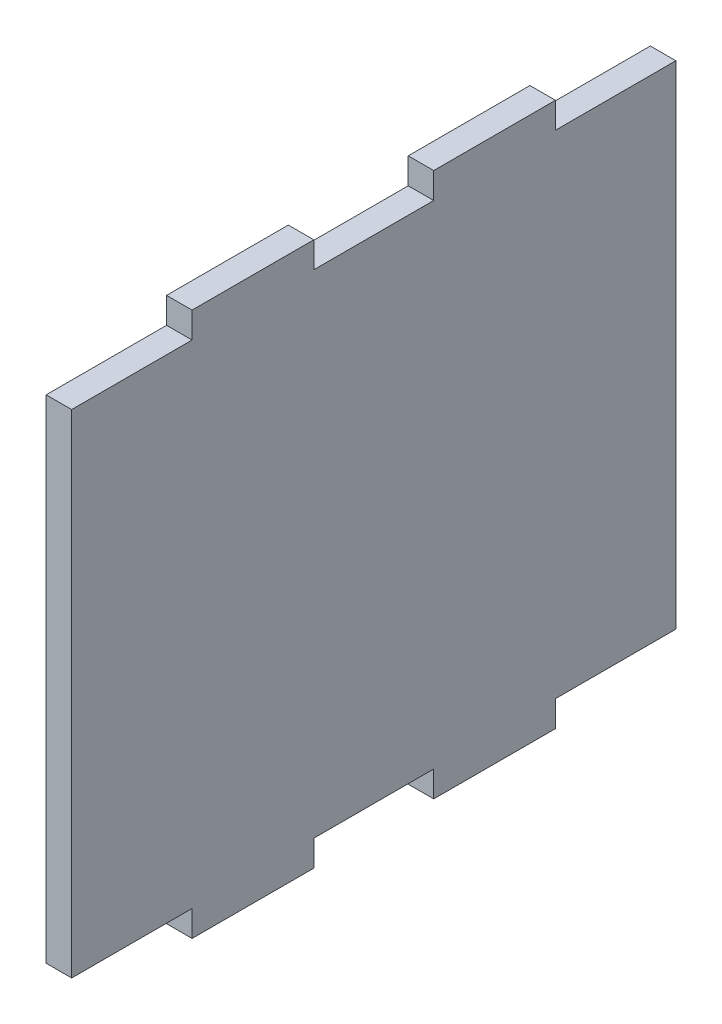
ISO-10303-21;
HEADER;
FILE_DESCRIPTION(('STEP AP214'),'2;1');
FILE_NAME('part.step','',(''),(''),'','','');
FILE_SCHEMA(('AUTOMOTIVE_DESIGN { 1 0 10303 214 1 1 1 1 }'));
ENDSEC;
DATA;
#1=APPLICATION_CONTEXT('core data for automotive mechanical design processes');
#2=APPLICATION_PROTOCOL_DEFINITION('international standard','automotive_design',2000,#1);
#3=PRODUCT_CONTEXT('',#1,'mechanical');
#4=PRODUCT('Part','Part','',(#3));
#5=PRODUCT_RELATED_PRODUCT_CATEGORY('part','',(#4));
#6=PRODUCT_DEFINITION_FORMATION('','',#4);
#7=PRODUCT_DEFINITION_CONTEXT('part definition',#1,'design');
#8=PRODUCT_DEFINITION('design','',#6,#7);
#9=PRODUCT_DEFINITION_SHAPE('','',#8);
#10=(LENGTH_UNIT() NAMED_UNIT(*) SI_UNIT(.MILLI.,.METRE.));
#11=(NAMED_UNIT(*) PLANE_ANGLE_UNIT() SI_UNIT($,.RADIAN.));
#12=(NAMED_UNIT(*) SI_UNIT($,.STERADIAN.) SOLID_ANGLE_UNIT());
#13=UNCERTAINTY_MEASURE_WITH_UNIT(LENGTH_MEASURE(1.E-05),#10,'distance_accuracy_value','');
#14=(GEOMETRIC_REPRESENTATION_CONTEXT(3) GLOBAL_UNCERTAINTY_ASSIGNED_CONTEXT((#13)) GLOBAL_UNIT_ASSIGNED_CONTEXT((#10,
#11,#12)) REPRESENTATION_CONTEXT('',''));
#15=CARTESIAN_POINT('',(0.,0.,0.));
#16=DIRECTION('',(0.,0.,1.));
#17=DIRECTION('',(1.,0.,0.));
#18=AXIS2_PLACEMENT_3D('',#15,#16,#17);
#19=CARTESIAN_POINT('',(5.7,0.,0.));
#20=DIRECTION('',(0.,0.,-1.));
#21=DIRECTION('',(-1.,0.,0.));
#22=AXIS2_PLACEMENT_3D('',#19,#20,#21);
#23=PLANE('',#22);
#24=DIRECTION('',(-1.,0.,0.));
#25=VECTOR('',#24,1.);
#26=CARTESIAN_POINT('',(57.,5.99999999999999,0.));
#27=LINE('',#26,#25);
#28=CARTESIAN_POINT('',(5.7,5.99999999999999,0.));
#29=VERTEX_POINT('',#28);
#30=CARTESIAN_POINT('',(0.,5.99999999999999,0.));
#31=VERTEX_POINT('',#30);
#32=EDGE_CURVE('E49',#29,#31,#27,.T.);
#33=ORIENTED_EDGE('',*,*,#32,.F.);
#34=DIRECTION('',(0.,-1.,0.));
#35=VECTOR('',#34,1.);
#36=CARTESIAN_POINT('',(5.7,0.,0.));
#37=LINE('',#36,#35);
#38=CARTESIAN_POINT('',(5.7,116.,0.));
#39=VERTEX_POINT('',#38);
#40=EDGE_CURVE('E41',#39,#29,#37,.T.);
#41=ORIENTED_EDGE('',*,*,#40,.F.);
#42=DIRECTION('',(-1.,0.,0.));
#43=VECTOR('',#42,1.);
#44=CARTESIAN_POINT('',(57.,116.,0.));
#45=LINE('',#44,#43);
#46=CARTESIAN_POINT('',(0.,116.,0.));
#47=VERTEX_POINT('',#46);
#48=EDGE_CURVE('E218',#39,#47,#45,.T.);
#49=ORIENTED_EDGE('',*,*,#48,.T.);
#50=DIRECTION('',(0.,-1.,0.));
#51=VECTOR('',#50,1.);
#52=CARTESIAN_POINT('',(0.,0.,0.));
#53=LINE('',#52,#51);
#54=EDGE_CURVE('E191',#47,#31,#53,.T.);
#55=ORIENTED_EDGE('',*,*,#54,.T.);
#56=EDGE_LOOP('',(#33,#41,#49,#55));
#57=FACE_BOUND('',#56,.T.);
#58=ADVANCED_FACE('F33',(#57),#23,.F.);
#59=CARTESIAN_POINT('',(5.7,0.,-135.));
#60=DIRECTION('',(0.,0.,1.));
#61=DIRECTION('',(1.,0.,0.));
#62=AXIS2_PLACEMENT_3D('',#59,#60,#61);
#63=PLANE('',#62);
#64=DIRECTION('',(-1.,0.,0.));
#65=VECTOR('',#64,1.);
#66=CARTESIAN_POINT('',(57.,5.99999999999999,-135.));
#67=LINE('',#66,#65);
#68=CARTESIAN_POINT('',(5.7,5.99999999999999,-135.));
#69=VERTEX_POINT('',#68);
#70=CARTESIAN_POINT('',(0.,5.99999999999999,-135.));
#71=VERTEX_POINT('',#70);
#72=EDGE_CURVE('E173',#69,#71,#67,.T.);
#73=ORIENTED_EDGE('',*,*,#72,.T.);
#74=DIRECTION('',(0.,1.,0.));
#75=VECTOR('',#74,1.);
#76=CARTESIAN_POINT('',(0.,0.,-135.));
#77=LINE('',#76,#75);
#78=CARTESIAN_POINT('',(0.,116.,-135.));
#79=VERTEX_POINT('',#78);
#80=EDGE_CURVE('E36',#71,#79,#77,.T.);
#81=ORIENTED_EDGE('',*,*,#80,.T.);
#82=DIRECTION('',(-1.,0.,0.));
#83=VECTOR('',#82,1.);
#84=CARTESIAN_POINT('',(57.,116.,-135.));
#85=LINE('',#84,#83);
#86=CARTESIAN_POINT('',(5.7,116.,-135.));
#87=VERTEX_POINT('',#86);
#88=EDGE_CURVE('E236',#87,#79,#85,.T.);
#89=ORIENTED_EDGE('',*,*,#88,.F.);
#90=DIRECTION('',(0.,1.,0.));
#91=VECTOR('',#90,1.);
#92=CARTESIAN_POINT('',(5.7,0.,-135.));
#93=LINE('',#92,#91);
#94=EDGE_CURVE('E11',#69,#87,#93,.T.);
#95=ORIENTED_EDGE('',*,*,#94,.F.);
#96=EDGE_LOOP('',(#73,#81,#89,#95));
#97=FACE_BOUND('',#96,.T.);
#98=ADVANCED_FACE('F183',(#97),#63,.F.);
#99=CARTESIAN_POINT('',(5.7,0.,0.));
#100=DIRECTION('',(-1.,0.,0.));
#101=DIRECTION('',(0.,0.,1.));
#102=AXIS2_PLACEMENT_3D('',#99,#100,#101);
#103=PLANE('',#102);
#104=DIRECTION('',(0.,0.,1.));
#105=VECTOR('',#104,1.);
#106=CARTESIAN_POINT('',(5.7,5.99999999999999,0.));
#107=LINE('',#106,#105);
#108=CARTESIAN_POINT('',(5.7,5.99999999999999,-108.1));
#109=VERTEX_POINT('',#108);
#110=EDGE_CURVE('E262',#69,#109,#107,.T.);
#111=ORIENTED_EDGE('',*,*,#110,.F.);
#112=ORIENTED_EDGE('',*,*,#94,.T.);
#113=DIRECTION('',(0.,0.,-1.));
#114=VECTOR('',#113,1.);
#115=CARTESIAN_POINT('',(5.7,116.,0.));
#116=LINE('',#115,#114);
#117=CARTESIAN_POINT('',(5.7,116.,-108.1));
#118=VERTEX_POINT('',#117);
#119=EDGE_CURVE('E215',#118,#87,#116,.T.);
#120=ORIENTED_EDGE('',*,*,#119,.F.);
#121=DIRECTION('',(0.,-1.,0.));
#122=VECTOR('',#121,1.);
#123=CARTESIAN_POINT('',(5.7,0.,-108.1));
#124=LINE('',#123,#122);
#125=CARTESIAN_POINT('',(5.7,121.8,-108.1));
#126=VERTEX_POINT('',#125);
#127=EDGE_CURVE('E213',#126,#118,#124,.T.);
#128=ORIENTED_EDGE('',*,*,#127,.F.);
#129=DIRECTION('',(0.,0.,-1.));
#130=VECTOR('',#129,1.);
#131=CARTESIAN_POINT('',(5.7,121.8,0.));
#132=LINE('',#131,#130);
#133=CARTESIAN_POINT('',(5.7,121.8,-80.9));
#134=VERTEX_POINT('',#133);
#135=EDGE_CURVE('E211',#134,#126,#132,.T.);
#136=ORIENTED_EDGE('',*,*,#135,.F.);
#137=DIRECTION('',(0.,1.,0.));
#138=VECTOR('',#137,1.);
#139=CARTESIAN_POINT('',(5.7,0.,-80.9));
#140=LINE('',#139,#138);
#141=CARTESIAN_POINT('',(5.7,116.,-80.9));
#142=VERTEX_POINT('',#141);
#143=EDGE_CURVE('E209',#142,#134,#140,.T.);
#144=ORIENTED_EDGE('',*,*,#143,.F.);
#145=DIRECTION('',(0.,0.,-1.));
#146=VECTOR('',#145,1.);
#147=CARTESIAN_POINT('',(5.7,116.,0.));
#148=LINE('',#147,#146);
#149=CARTESIAN_POINT('',(5.7,116.,-54.1));
#150=VERTEX_POINT('',#149);
#151=EDGE_CURVE('E207',#150,#142,#148,.T.);
#152=ORIENTED_EDGE('',*,*,#151,.F.);
#153=DIRECTION('',(0.,-1.,0.));
#154=VECTOR('',#153,1.);
#155=CARTESIAN_POINT('',(5.7,0.,-54.1));
#156=LINE('',#155,#154);
#157=CARTESIAN_POINT('',(5.7,121.8,-54.1));
#158=VERTEX_POINT('',#157);
#159=EDGE_CURVE('E205',#158,#150,#156,.T.);
#160=ORIENTED_EDGE('',*,*,#159,.F.);
#161=DIRECTION('',(0.,0.,-1.));
#162=VECTOR('',#161,1.);
#163=CARTESIAN_POINT('',(5.7,121.8,0.));
#164=LINE('',#163,#162);
#165=CARTESIAN_POINT('',(5.7,121.8,-26.9));
#166=VERTEX_POINT('',#165);
#167=EDGE_CURVE('E203',#166,#158,#164,.T.);
#168=ORIENTED_EDGE('',*,*,#167,.F.);
#169=DIRECTION('',(0.,1.,0.));
#170=VECTOR('',#169,1.);
#171=CARTESIAN_POINT('',(5.7,0.,-26.9));
#172=LINE('',#171,#170);
#173=CARTESIAN_POINT('',(5.7,116.,-26.9));
#174=VERTEX_POINT('',#173);
#175=EDGE_CURVE('E199',#174,#166,#172,.T.);
#176=ORIENTED_EDGE('',*,*,#175,.F.);
#177=DIRECTION('',(0.,0.,-1.));
#178=VECTOR('',#177,1.);
#179=CARTESIAN_POINT('',(5.7,116.,0.));
#180=LINE('',#179,#178);
#181=EDGE_CURVE('E195',#39,#174,#180,.T.);
#182=ORIENTED_EDGE('',*,*,#181,.F.);
#183=ORIENTED_EDGE('',*,*,#40,.T.);
#184=DIRECTION('',(0.,0.,1.));
#185=VECTOR('',#184,1.);
#186=CARTESIAN_POINT('',(5.7,5.99999999999999,0.));
#187=LINE('',#186,#185);
#188=CARTESIAN_POINT('',(5.7,5.99999999999999,-26.9));
#189=VERTEX_POINT('',#188);
#190=EDGE_CURVE('E184',#189,#29,#187,.T.);
#191=ORIENTED_EDGE('',*,*,#190,.F.);
#192=DIRECTION('',(0.,1.,0.));
#193=VECTOR('',#192,1.);
#194=CARTESIAN_POINT('',(5.7,0.,-26.9));
#195=LINE('',#194,#193);
#196=CARTESIAN_POINT('',(5.7,0.199999999999992,-26.9));
#197=VERTEX_POINT('',#196);
#198=EDGE_CURVE('E276',#197,#189,#195,.T.);
#199=ORIENTED_EDGE('',*,*,#198,.F.);
#200=DIRECTION('',(0.,0.,1.));
#201=VECTOR('',#200,1.);
#202=CARTESIAN_POINT('',(5.7,0.199999999999992,0.));
#203=LINE('',#202,#201);
#204=CARTESIAN_POINT('',(5.7,0.199999999999992,-54.1));
#205=VERTEX_POINT('',#204);
#206=EDGE_CURVE('E274',#205,#197,#203,.T.);
#207=ORIENTED_EDGE('',*,*,#206,.F.);
#208=DIRECTION('',(0.,-1.,0.));
#209=VECTOR('',#208,1.);
#210=CARTESIAN_POINT('',(5.7,0.,-54.1));
#211=LINE('',#210,#209);
#212=CARTESIAN_POINT('',(5.7,5.99999999999999,-54.1));
#213=VERTEX_POINT('',#212);
#214=EDGE_CURVE('E272',#213,#205,#211,.T.);
#215=ORIENTED_EDGE('',*,*,#214,.F.);
#216=DIRECTION('',(0.,0.,1.));
#217=VECTOR('',#216,1.);
#218=CARTESIAN_POINT('',(5.7,5.99999999999999,0.));
#219=LINE('',#218,#217);
#220=CARTESIAN_POINT('',(5.7,5.99999999999999,-80.9));
#221=VERTEX_POINT('',#220);
#222=EDGE_CURVE('E270',#221,#213,#219,.T.);
#223=ORIENTED_EDGE('',*,*,#222,.F.);
#224=DIRECTION('',(0.,1.,0.));
#225=VECTOR('',#224,1.);
#226=CARTESIAN_POINT('',(5.7,0.,-80.9));
#227=LINE('',#226,#225);
#228=CARTESIAN_POINT('',(5.7,0.199999999999992,-80.9));
#229=VERTEX_POINT('',#228);
#230=EDGE_CURVE('E268',#229,#221,#227,.T.);
#231=ORIENTED_EDGE('',*,*,#230,.F.);
#232=DIRECTION('',(0.,0.,1.));
#233=VECTOR('',#232,1.);
#234=CARTESIAN_POINT('',(5.7,0.199999999999992,0.));
#235=LINE('',#234,#233);
#236=CARTESIAN_POINT('',(5.7,0.199999999999992,-108.1));
#237=VERTEX_POINT('',#236);
#238=EDGE_CURVE('E266',#237,#229,#235,.T.);
#239=ORIENTED_EDGE('',*,*,#238,.F.);
#240=DIRECTION('',(0.,-1.,0.));
#241=VECTOR('',#240,1.);
#242=CARTESIAN_POINT('',(5.7,0.,-108.1));
#243=LINE('',#242,#241);
#244=EDGE_CURVE('E264',#109,#237,#243,.T.);
#245=ORIENTED_EDGE('',*,*,#244,.F.);
#246=EDGE_LOOP('',(#111,#112,#120,#128,#136,#144,#152,#160,#168,#176,#182,#183,#191,#199,#207,
#215,#223,#231,#239,#245));
#247=FACE_BOUND('',#246,.T.);
#248=ADVANCED_FACE('F361',(#247),#103,.F.);
#249=CARTESIAN_POINT('',(0.,0.,0.));
#250=DIRECTION('',(-1.,0.,0.));
#251=DIRECTION('',(0.,0.,1.));
#252=AXIS2_PLACEMENT_3D('',#249,#250,#251);
#253=PLANE('',#252);
#254=ORIENTED_EDGE('',*,*,#80,.F.);
#255=DIRECTION('',(0.,0.,1.));
#256=VECTOR('',#255,1.);
#257=CARTESIAN_POINT('',(0.,5.99999999999999,-108.1));
#258=LINE('',#257,#256);
#259=CARTESIAN_POINT('',(0.,5.99999999999999,-108.1));
#260=VERTEX_POINT('',#259);
#261=EDGE_CURVE('E171',#71,#260,#258,.T.);
#262=ORIENTED_EDGE('',*,*,#261,.T.);
#263=DIRECTION('',(0.,-1.,0.));
#264=VECTOR('',#263,1.);
#265=CARTESIAN_POINT('',(0.,0.199999999999992,-108.1));
#266=LINE('',#265,#264);
#267=CARTESIAN_POINT('',(0.,0.199999999999992,-108.1));
#268=VERTEX_POINT('',#267);
#269=EDGE_CURVE('E180',#260,#268,#266,.T.);
#270=ORIENTED_EDGE('',*,*,#269,.T.);
#271=DIRECTION('',(0.,0.,1.));
#272=VECTOR('',#271,1.);
#273=CARTESIAN_POINT('',(0.,0.199999999999992,-80.9));
#274=LINE('',#273,#272);
#275=CARTESIAN_POINT('',(0.,0.199999999999992,-80.9));
#276=VERTEX_POINT('',#275);
#277=EDGE_CURVE('E312',#268,#276,#274,.T.);
#278=ORIENTED_EDGE('',*,*,#277,.T.);
#279=DIRECTION('',(0.,1.,0.));
#280=VECTOR('',#279,1.);
#281=CARTESIAN_POINT('',(0.,5.99999999999999,-80.9));
#282=LINE('',#281,#280);
#283=CARTESIAN_POINT('',(0.,5.99999999999999,-80.9));
#284=VERTEX_POINT('',#283);
#285=EDGE_CURVE('E309',#276,#284,#282,.T.);
#286=ORIENTED_EDGE('',*,*,#285,.T.);
#287=DIRECTION('',(0.,0.,1.));
#288=VECTOR('',#287,1.);
#289=CARTESIAN_POINT('',(0.,5.99999999999999,-54.1));
#290=LINE('',#289,#288);
#291=CARTESIAN_POINT('',(0.,5.99999999999999,-54.1));
#292=VERTEX_POINT('',#291);
#293=EDGE_CURVE('E306',#284,#292,#290,.T.);
#294=ORIENTED_EDGE('',*,*,#293,.T.);
#295=DIRECTION('',(0.,-1.,0.));
#296=VECTOR('',#295,1.);
#297=CARTESIAN_POINT('',(0.,0.199999999999992,-54.1));
#298=LINE('',#297,#296);
#299=CARTESIAN_POINT('',(0.,0.199999999999992,-54.1));
#300=VERTEX_POINT('',#299);
#301=EDGE_CURVE('E303',#292,#300,#298,.T.);
#302=ORIENTED_EDGE('',*,*,#301,.T.);
#303=DIRECTION('',(0.,0.,1.));
#304=VECTOR('',#303,1.);
#305=CARTESIAN_POINT('',(0.,0.199999999999992,-26.9));
#306=LINE('',#305,#304);
#307=CARTESIAN_POINT('',(0.,0.199999999999992,-26.9));
#308=VERTEX_POINT('',#307);
#309=EDGE_CURVE('E300',#300,#308,#306,.T.);
#310=ORIENTED_EDGE('',*,*,#309,.T.);
#311=DIRECTION('',(0.,1.,0.));
#312=VECTOR('',#311,1.);
#313=CARTESIAN_POINT('',(0.,5.99999999999999,-26.9));
#314=LINE('',#313,#312);
#315=CARTESIAN_POINT('',(0.,5.99999999999999,-26.9));
#316=VERTEX_POINT('',#315);
#317=EDGE_CURVE('E297',#308,#316,#314,.T.);
#318=ORIENTED_EDGE('',*,*,#317,.T.);
#319=DIRECTION('',(0.,0.,1.));
#320=VECTOR('',#319,1.);
#321=CARTESIAN_POINT('',(0.,5.99999999999999,0.));
#322=LINE('',#321,#320);
#323=EDGE_CURVE('E295',#316,#31,#322,.T.);
#324=ORIENTED_EDGE('',*,*,#323,.T.);
#325=ORIENTED_EDGE('',*,*,#54,.F.);
#326=DIRECTION('',(0.,0.,-1.));
#327=VECTOR('',#326,1.);
#328=CARTESIAN_POINT('',(0.,116.,0.));
#329=LINE('',#328,#327);
#330=CARTESIAN_POINT('',(0.,116.,-26.9));
#331=VERTEX_POINT('',#330);
#332=EDGE_CURVE('E259',#47,#331,#329,.T.);
#333=ORIENTED_EDGE('',*,*,#332,.T.);
#334=DIRECTION('',(0.,1.,0.));
#335=VECTOR('',#334,1.);
#336=CARTESIAN_POINT('',(0.,116.,-26.9));
#337=LINE('',#336,#335);
#338=CARTESIAN_POINT('',(0.,121.8,-26.9));
#339=VERTEX_POINT('',#338);
#340=EDGE_CURVE('E256',#331,#339,#337,.T.);
#341=ORIENTED_EDGE('',*,*,#340,.T.);
#342=DIRECTION('',(0.,0.,-1.));
#343=VECTOR('',#342,1.);
#344=CARTESIAN_POINT('',(0.,121.8,-26.9));
#345=LINE('',#344,#343);
#346=CARTESIAN_POINT('',(0.,121.8,-54.1));
#347=VERTEX_POINT('',#346);
#348=EDGE_CURVE('E253',#339,#347,#345,.T.);
#349=ORIENTED_EDGE('',*,*,#348,.T.);
#350=DIRECTION('',(0.,-1.,0.));
#351=VECTOR('',#350,1.);
#352=CARTESIAN_POINT('',(0.,121.8,-54.1));
#353=LINE('',#352,#351);
#354=CARTESIAN_POINT('',(0.,116.,-54.1));
#355=VERTEX_POINT('',#354);
#356=EDGE_CURVE('E250',#347,#355,#353,.T.);
#357=ORIENTED_EDGE('',*,*,#356,.T.);
#358=DIRECTION('',(0.,0.,-1.));
#359=VECTOR('',#358,1.);
#360=CARTESIAN_POINT('',(0.,116.,-54.1));
#361=LINE('',#360,#359);
#362=CARTESIAN_POINT('',(0.,116.,-80.9));
#363=VERTEX_POINT('',#362);
#364=EDGE_CURVE('E247',#355,#363,#361,.T.);
#365=ORIENTED_EDGE('',*,*,#364,.T.);
#366=DIRECTION('',(0.,1.,0.));
#367=VECTOR('',#366,1.);
#368=CARTESIAN_POINT('',(0.,116.,-80.9));
#369=LINE('',#368,#367);
#370=CARTESIAN_POINT('',(0.,121.8,-80.9));
#371=VERTEX_POINT('',#370);
#372=EDGE_CURVE('E244',#363,#371,#369,.T.);
#373=ORIENTED_EDGE('',*,*,#372,.T.);
#374=DIRECTION('',(0.,0.,-1.));
#375=VECTOR('',#374,1.);
#376=CARTESIAN_POINT('',(0.,121.8,-80.9));
#377=LINE('',#376,#375);
#378=CARTESIAN_POINT('',(0.,121.8,-108.1));
#379=VERTEX_POINT('',#378);
#380=EDGE_CURVE('E241',#371,#379,#377,.T.);
#381=ORIENTED_EDGE('',*,*,#380,.T.);
#382=DIRECTION('',(0.,-1.,0.));
#383=VECTOR('',#382,1.);
#384=CARTESIAN_POINT('',(0.,121.8,-108.1));
#385=LINE('',#384,#383);
#386=CARTESIAN_POINT('',(0.,116.,-108.1));
#387=VERTEX_POINT('',#386);
#388=EDGE_CURVE('E239',#379,#387,#385,.T.);
#389=ORIENTED_EDGE('',*,*,#388,.T.);
#390=DIRECTION('',(0.,0.,-1.));
#391=VECTOR('',#390,1.);
#392=CARTESIAN_POINT('',(0.,116.,-108.1));
#393=LINE('',#392,#391);
#394=EDGE_CURVE('E190',#387,#79,#393,.T.);
#395=ORIENTED_EDGE('',*,*,#394,.T.);
#396=EDGE_LOOP('',(#254,#262,#270,#278,#286,#294,#302,#310,#318,#324,#325,#333,#341,#349,#357,
#365,#373,#381,#389,#395));
#397=FACE_BOUND('',#396,.T.);
#398=ADVANCED_FACE('F187',(#397),#253,.T.);
#399=CARTESIAN_POINT('',(57.,116.,0.));
#400=DIRECTION('',(0.,1.,0.));
#401=DIRECTION('',(0.,0.,1.));
#402=AXIS2_PLACEMENT_3D('',#399,#400,#401);
#403=PLANE('',#402);
#404=ORIENTED_EDGE('',*,*,#181,.T.);
#405=DIRECTION('',(-1.,0.,0.));
#406=VECTOR('',#405,1.);
#407=CARTESIAN_POINT('',(57.,116.,-26.9));
#408=LINE('',#407,#406);
#409=EDGE_CURVE('E220',#174,#331,#408,.T.);
#410=ORIENTED_EDGE('',*,*,#409,.T.);
#411=ORIENTED_EDGE('',*,*,#332,.F.);
#412=ORIENTED_EDGE('',*,*,#48,.F.);
#413=EDGE_LOOP('',(#404,#410,#411,#412));
#414=FACE_BOUND('',#413,.T.);
#415=ADVANCED_FACE('F369',(#414),#403,.T.);
#416=CARTESIAN_POINT('',(57.,116.,-26.9));
#417=DIRECTION('',(0.,0.,1.));
#418=DIRECTION('',(1.,0.,0.));
#419=AXIS2_PLACEMENT_3D('',#416,#417,#418);
#420=PLANE('',#419);
#421=ORIENTED_EDGE('',*,*,#175,.T.);
#422=DIRECTION('',(-1.,0.,0.));
#423=VECTOR('',#422,1.);
#424=CARTESIAN_POINT('',(57.,121.8,-26.9));
#425=LINE('',#424,#423);
#426=EDGE_CURVE('E222',#166,#339,#425,.T.);
#427=ORIENTED_EDGE('',*,*,#426,.T.);
#428=ORIENTED_EDGE('',*,*,#340,.F.);
#429=ORIENTED_EDGE('',*,*,#409,.F.);
#430=EDGE_LOOP('',(#421,#427,#428,#429));
#431=FACE_BOUND('',#430,.T.);
#432=ADVANCED_FACE('F372',(#431),#420,.T.);
#433=CARTESIAN_POINT('',(57.,121.8,-26.9));
#434=DIRECTION('',(0.,1.,0.));
#435=DIRECTION('',(0.,0.,1.));
#436=AXIS2_PLACEMENT_3D('',#433,#434,#435);
#437=PLANE('',#436);
#438=ORIENTED_EDGE('',*,*,#167,.T.);
#439=DIRECTION('',(-1.,0.,0.));
#440=VECTOR('',#439,1.);
#441=CARTESIAN_POINT('',(57.,121.8,-54.1));
#442=LINE('',#441,#440);
#443=EDGE_CURVE('E224',#158,#347,#442,.T.);
#444=ORIENTED_EDGE('',*,*,#443,.T.);
#445=ORIENTED_EDGE('',*,*,#348,.F.);
#446=ORIENTED_EDGE('',*,*,#426,.F.);
#447=EDGE_LOOP('',(#438,#444,#445,#446));
#448=FACE_BOUND('',#447,.T.);
#449=ADVANCED_FACE('F377',(#448),#437,.T.);
#450=CARTESIAN_POINT('',(57.,121.8,-54.1));
#451=DIRECTION('',(0.,0.,-1.));
#452=DIRECTION('',(-1.,0.,0.));
#453=AXIS2_PLACEMENT_3D('',#450,#451,#452);
#454=PLANE('',#453);
#455=ORIENTED_EDGE('',*,*,#159,.T.);
#456=DIRECTION('',(-1.,0.,0.));
#457=VECTOR('',#456,1.);
#458=CARTESIAN_POINT('',(57.,116.,-54.1));
#459=LINE('',#458,#457);
#460=EDGE_CURVE('E226',#150,#355,#459,.T.);
#461=ORIENTED_EDGE('',*,*,#460,.T.);
#462=ORIENTED_EDGE('',*,*,#356,.F.);
#463=ORIENTED_EDGE('',*,*,#443,.F.);
#464=EDGE_LOOP('',(#455,#461,#462,#463));
#465=FACE_BOUND('',#464,.T.);
#466=ADVANCED_FACE('F381',(#465),#454,.T.);
#467=CARTESIAN_POINT('',(57.,116.,-54.1));
#468=DIRECTION('',(0.,1.,0.));
#469=DIRECTION('',(0.,0.,1.));
#470=AXIS2_PLACEMENT_3D('',#467,#468,#469);
#471=PLANE('',#470);
#472=ORIENTED_EDGE('',*,*,#151,.T.);
#473=DIRECTION('',(-1.,0.,0.));
#474=VECTOR('',#473,1.);
#475=CARTESIAN_POINT('',(57.,116.,-80.9));
#476=LINE('',#475,#474);
#477=EDGE_CURVE('E228',#142,#363,#476,.T.);
#478=ORIENTED_EDGE('',*,*,#477,.T.);
#479=ORIENTED_EDGE('',*,*,#364,.F.);
#480=ORIENTED_EDGE('',*,*,#460,.F.);
#481=EDGE_LOOP('',(#472,#478,#479,#480));
#482=FACE_BOUND('',#481,.T.);
#483=ADVANCED_FACE('F386',(#482),#471,.T.);
#484=CARTESIAN_POINT('',(57.,116.,-80.9));
#485=DIRECTION('',(0.,0.,1.));
#486=DIRECTION('',(1.,0.,0.));
#487=AXIS2_PLACEMENT_3D('',#484,#485,#486);
#488=PLANE('',#487);
#489=ORIENTED_EDGE('',*,*,#143,.T.);
#490=DIRECTION('',(-1.,0.,0.));
#491=VECTOR('',#490,1.);
#492=CARTESIAN_POINT('',(57.,121.8,-80.9));
#493=LINE('',#492,#491);
#494=EDGE_CURVE('E230',#134,#371,#493,.T.);
#495=ORIENTED_EDGE('',*,*,#494,.T.);
#496=ORIENTED_EDGE('',*,*,#372,.F.);
#497=ORIENTED_EDGE('',*,*,#477,.F.);
#498=EDGE_LOOP('',(#489,#495,#496,#497));
#499=FACE_BOUND('',#498,.T.);
#500=ADVANCED_FACE('F391',(#499),#488,.T.);
#501=CARTESIAN_POINT('',(57.,121.8,-80.9));
#502=DIRECTION('',(0.,1.,0.));
#503=DIRECTION('',(0.,0.,1.));
#504=AXIS2_PLACEMENT_3D('',#501,#502,#503);
#505=PLANE('',#504);
#506=ORIENTED_EDGE('',*,*,#135,.T.);
#507=DIRECTION('',(-1.,0.,0.));
#508=VECTOR('',#507,1.);
#509=CARTESIAN_POINT('',(57.,121.8,-108.1));
#510=LINE('',#509,#508);
#511=EDGE_CURVE('E232',#126,#379,#510,.T.);
#512=ORIENTED_EDGE('',*,*,#511,.T.);
#513=ORIENTED_EDGE('',*,*,#380,.F.);
#514=ORIENTED_EDGE('',*,*,#494,.F.);
#515=EDGE_LOOP('',(#506,#512,#513,#514));
#516=FACE_BOUND('',#515,.T.);
#517=ADVANCED_FACE('F396',(#516),#505,.T.);
#518=CARTESIAN_POINT('',(57.,121.8,-108.1));
#519=DIRECTION('',(0.,0.,-1.));
#520=DIRECTION('',(-1.,0.,0.));
#521=AXIS2_PLACEMENT_3D('',#518,#519,#520);
#522=PLANE('',#521);
#523=ORIENTED_EDGE('',*,*,#127,.T.);
#524=DIRECTION('',(-1.,0.,0.));
#525=VECTOR('',#524,1.);
#526=CARTESIAN_POINT('',(57.,116.,-108.1));
#527=LINE('',#526,#525);
#528=EDGE_CURVE('E234',#118,#387,#527,.T.);
#529=ORIENTED_EDGE('',*,*,#528,.T.);
#530=ORIENTED_EDGE('',*,*,#388,.F.);
#531=ORIENTED_EDGE('',*,*,#511,.F.);
#532=EDGE_LOOP('',(#523,#529,#530,#531));
#533=FACE_BOUND('',#532,.T.);
#534=ADVANCED_FACE('F401',(#533),#522,.T.);
#535=CARTESIAN_POINT('',(57.,116.,-108.1));
#536=DIRECTION('',(0.,1.,0.));
#537=DIRECTION('',(0.,0.,1.));
#538=AXIS2_PLACEMENT_3D('',#535,#536,#537);
#539=PLANE('',#538);
#540=ORIENTED_EDGE('',*,*,#119,.T.);
#541=ORIENTED_EDGE('',*,*,#88,.T.);
#542=ORIENTED_EDGE('',*,*,#394,.F.);
#543=ORIENTED_EDGE('',*,*,#528,.F.);
#544=EDGE_LOOP('',(#540,#541,#542,#543));
#545=FACE_BOUND('',#544,.T.);
#546=ADVANCED_FACE('F405',(#545),#539,.T.);
#547=CARTESIAN_POINT('',(57.,5.99999999999999,-108.1));
#548=DIRECTION('',(0.,-1.,0.));
#549=DIRECTION('',(0.,0.,-1.));
#550=AXIS2_PLACEMENT_3D('',#547,#548,#549);
#551=PLANE('',#550);
#552=ORIENTED_EDGE('',*,*,#110,.T.);
#553=DIRECTION('',(-1.,0.,0.));
#554=VECTOR('',#553,1.);
#555=CARTESIAN_POINT('',(57.,5.99999999999999,-108.1));
#556=LINE('',#555,#554);
#557=EDGE_CURVE('E176',#109,#260,#556,.T.);
#558=ORIENTED_EDGE('',*,*,#557,.T.);
#559=ORIENTED_EDGE('',*,*,#261,.F.);
#560=ORIENTED_EDGE('',*,*,#72,.F.);
#561=EDGE_LOOP('',(#552,#558,#559,#560));
#562=FACE_BOUND('',#561,.T.);
#563=ADVANCED_FACE('F172',(#562),#551,.T.);
#564=CARTESIAN_POINT('',(57.,0.199999999999992,-108.1));
#565=DIRECTION('',(0.,0.,-1.));
#566=DIRECTION('',(-1.,0.,0.));
#567=AXIS2_PLACEMENT_3D('',#564,#565,#566);
#568=PLANE('',#567);
#569=ORIENTED_EDGE('',*,*,#244,.T.);
#570=DIRECTION('',(-1.,0.,0.));
#571=VECTOR('',#570,1.);
#572=CARTESIAN_POINT('',(57.,0.199999999999992,-108.1));
#573=LINE('',#572,#571);
#574=EDGE_CURVE('E280',#237,#268,#573,.T.);
#575=ORIENTED_EDGE('',*,*,#574,.T.);
#576=ORIENTED_EDGE('',*,*,#269,.F.);
#577=ORIENTED_EDGE('',*,*,#557,.F.);
#578=EDGE_LOOP('',(#569,#575,#576,#577));
#579=FACE_BOUND('',#578,.T.);
#580=ADVANCED_FACE('F317',(#579),#568,.T.);
#581=CARTESIAN_POINT('',(57.,0.199999999999992,-80.9));
#582=DIRECTION('',(0.,-1.,0.));
#583=DIRECTION('',(0.,0.,-1.));
#584=AXIS2_PLACEMENT_3D('',#581,#582,#583);
#585=PLANE('',#584);
#586=ORIENTED_EDGE('',*,*,#238,.T.);
#587=DIRECTION('',(-1.,0.,0.));
#588=VECTOR('',#587,1.);
#589=CARTESIAN_POINT('',(57.,0.199999999999992,-80.9));
#590=LINE('',#589,#588);
#591=EDGE_CURVE('E282',#229,#276,#590,.T.);
#592=ORIENTED_EDGE('',*,*,#591,.T.);
#593=ORIENTED_EDGE('',*,*,#277,.F.);
#594=ORIENTED_EDGE('',*,*,#574,.F.);
#595=EDGE_LOOP('',(#586,#592,#593,#594));
#596=FACE_BOUND('',#595,.T.);
#597=ADVANCED_FACE('F322',(#596),#585,.T.);
#598=CARTESIAN_POINT('',(57.,5.99999999999999,-80.9));
#599=DIRECTION('',(0.,0.,1.));
#600=DIRECTION('',(1.,0.,0.));
#601=AXIS2_PLACEMENT_3D('',#598,#599,#600);
#602=PLANE('',#601);
#603=ORIENTED_EDGE('',*,*,#230,.T.);
#604=DIRECTION('',(-1.,0.,0.));
#605=VECTOR('',#604,1.);
#606=CARTESIAN_POINT('',(57.,5.99999999999999,-80.9));
#607=LINE('',#606,#605);
#608=EDGE_CURVE('E284',#221,#284,#607,.T.);
#609=ORIENTED_EDGE('',*,*,#608,.T.);
#610=ORIENTED_EDGE('',*,*,#285,.F.);
#611=ORIENTED_EDGE('',*,*,#591,.F.);
#612=EDGE_LOOP('',(#603,#609,#610,#611));
#613=FACE_BOUND('',#612,.T.);
#614=ADVANCED_FACE('F327',(#613),#602,.T.);
#615=CARTESIAN_POINT('',(57.,5.99999999999999,-54.1));
#616=DIRECTION('',(0.,-1.,0.));
#617=DIRECTION('',(0.,0.,-1.));
#618=AXIS2_PLACEMENT_3D('',#615,#616,#617);
#619=PLANE('',#618);
#620=ORIENTED_EDGE('',*,*,#222,.T.);
#621=DIRECTION('',(-1.,0.,0.));
#622=VECTOR('',#621,1.);
#623=CARTESIAN_POINT('',(57.,5.99999999999999,-54.1));
#624=LINE('',#623,#622);
#625=EDGE_CURVE('E286',#213,#292,#624,.T.);
#626=ORIENTED_EDGE('',*,*,#625,.T.);
#627=ORIENTED_EDGE('',*,*,#293,.F.);
#628=ORIENTED_EDGE('',*,*,#608,.F.);
#629=EDGE_LOOP('',(#620,#626,#627,#628));
#630=FACE_BOUND('',#629,.T.);
#631=ADVANCED_FACE('F332',(#630),#619,.T.);
#632=CARTESIAN_POINT('',(57.,0.199999999999992,-54.1));
#633=DIRECTION('',(0.,0.,-1.));
#634=DIRECTION('',(-1.,0.,0.));
#635=AXIS2_PLACEMENT_3D('',#632,#633,#634);
#636=PLANE('',#635);
#637=ORIENTED_EDGE('',*,*,#214,.T.);
#638=DIRECTION('',(-1.,0.,0.));
#639=VECTOR('',#638,1.);
#640=CARTESIAN_POINT('',(57.,0.199999999999992,-54.1));
#641=LINE('',#640,#639);
#642=EDGE_CURVE('E288',#205,#300,#641,.T.);
#643=ORIENTED_EDGE('',*,*,#642,.T.);
#644=ORIENTED_EDGE('',*,*,#301,.F.);
#645=ORIENTED_EDGE('',*,*,#625,.F.);
#646=EDGE_LOOP('',(#637,#643,#644,#645));
#647=FACE_BOUND('',#646,.T.);
#648=ADVANCED_FACE('F337',(#647),#636,.T.);
#649=CARTESIAN_POINT('',(57.,0.199999999999992,-26.9));
#650=DIRECTION('',(0.,-1.,0.));
#651=DIRECTION('',(0.,0.,-1.));
#652=AXIS2_PLACEMENT_3D('',#649,#650,#651);
#653=PLANE('',#652);
#654=ORIENTED_EDGE('',*,*,#206,.T.);
#655=DIRECTION('',(-1.,0.,0.));
#656=VECTOR('',#655,1.);
#657=CARTESIAN_POINT('',(57.,0.199999999999992,-26.9));
#658=LINE('',#657,#656);
#659=EDGE_CURVE('E290',#197,#308,#658,.T.);
#660=ORIENTED_EDGE('',*,*,#659,.T.);
#661=ORIENTED_EDGE('',*,*,#309,.F.);
#662=ORIENTED_EDGE('',*,*,#642,.F.);
#663=EDGE_LOOP('',(#654,#660,#661,#662));
#664=FACE_BOUND('',#663,.T.);
#665=ADVANCED_FACE('F342',(#664),#653,.T.);
#666=CARTESIAN_POINT('',(57.,5.99999999999999,-26.9));
#667=DIRECTION('',(0.,0.,1.));
#668=DIRECTION('',(1.,0.,0.));
#669=AXIS2_PLACEMENT_3D('',#666,#667,#668);
#670=PLANE('',#669);
#671=ORIENTED_EDGE('',*,*,#198,.T.);
#672=DIRECTION('',(-1.,0.,0.));
#673=VECTOR('',#672,1.);
#674=CARTESIAN_POINT('',(57.,5.99999999999999,-26.9));
#675=LINE('',#674,#673);
#676=EDGE_CURVE('E292',#189,#316,#675,.T.);
#677=ORIENTED_EDGE('',*,*,#676,.T.);
#678=ORIENTED_EDGE('',*,*,#317,.F.);
#679=ORIENTED_EDGE('',*,*,#659,.F.);
#680=EDGE_LOOP('',(#671,#677,#678,#679));
#681=FACE_BOUND('',#680,.T.);
#682=ADVANCED_FACE('F346',(#681),#670,.T.);
#683=CARTESIAN_POINT('',(57.,5.99999999999999,0.));
#684=DIRECTION('',(0.,-1.,0.));
#685=DIRECTION('',(0.,0.,-1.));
#686=AXIS2_PLACEMENT_3D('',#683,#684,#685);
#687=PLANE('',#686);
#688=ORIENTED_EDGE('',*,*,#190,.T.);
#689=ORIENTED_EDGE('',*,*,#32,.T.);
#690=ORIENTED_EDGE('',*,*,#323,.F.);
#691=ORIENTED_EDGE('',*,*,#676,.F.);
#692=EDGE_LOOP('',(#688,#689,#690,#691));
#693=FACE_BOUND('',#692,.T.);
#694=ADVANCED_FACE('F350',(#693),#687,.T.);
#695=CLOSED_SHELL('',(#58,#98,#248,#398,#415,#432,#449,#466,#483,#500,#517,#534,#546,#563,#580,
#597,#614,#631,#648,#665,#682,#694));
#696=MANIFOLD_SOLID_BREP('B2',#695);
#697=ADVANCED_BREP_SHAPE_REPRESENTATION('',(#18,#696),#14);
#698=SHAPE_DEFINITION_REPRESENTATION(#9,#697);
ENDSEC;
END-ISO-10303-21;
